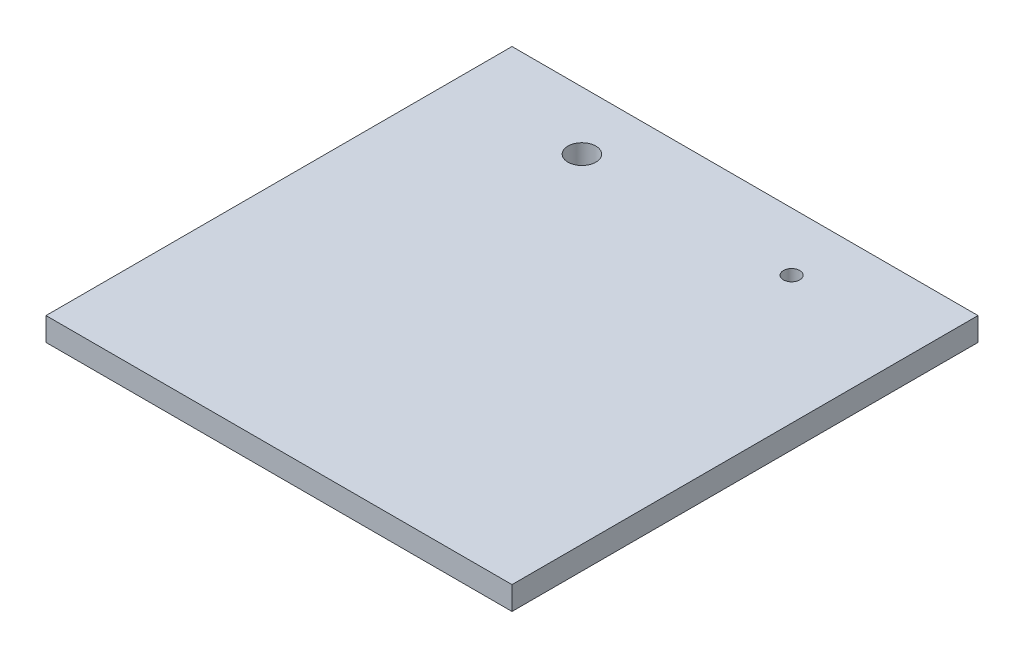
ISO-10303-21;
HEADER;
FILE_DESCRIPTION(('STEP AP214'),'2;1');
FILE_NAME('part.step','',(''),(''),'','','');
FILE_SCHEMA(('AUTOMOTIVE_DESIGN { 1 0 10303 214 1 1 1 1 }'));
ENDSEC;
DATA;
#1=APPLICATION_CONTEXT('core data for automotive mechanical design processes');
#2=APPLICATION_PROTOCOL_DEFINITION('international standard','automotive_design',2000,#1);
#3=PRODUCT_CONTEXT('',#1,'mechanical');
#4=PRODUCT('Part','Part','',(#3));
#5=PRODUCT_RELATED_PRODUCT_CATEGORY('part','',(#4));
#6=PRODUCT_DEFINITION_FORMATION('','',#4);
#7=PRODUCT_DEFINITION_CONTEXT('part definition',#1,'design');
#8=PRODUCT_DEFINITION('design','',#6,#7);
#9=PRODUCT_DEFINITION_SHAPE('','',#8);
#10=(LENGTH_UNIT() NAMED_UNIT(*) SI_UNIT(.MILLI.,.METRE.));
#11=(NAMED_UNIT(*) PLANE_ANGLE_UNIT() SI_UNIT($,.RADIAN.));
#12=(NAMED_UNIT(*) SI_UNIT($,.STERADIAN.) SOLID_ANGLE_UNIT());
#13=UNCERTAINTY_MEASURE_WITH_UNIT(LENGTH_MEASURE(1.E-05),#10,'distance_accuracy_value','');
#14=(GEOMETRIC_REPRESENTATION_CONTEXT(3) GLOBAL_UNCERTAINTY_ASSIGNED_CONTEXT((#13)) GLOBAL_UNIT_ASSIGNED_CONTEXT((#10,
#11,#12)) REPRESENTATION_CONTEXT('',''));
#15=CARTESIAN_POINT('',(0.,0.,0.));
#16=DIRECTION('',(0.,0.,1.));
#17=DIRECTION('',(1.,0.,0.));
#18=AXIS2_PLACEMENT_3D('',#15,#16,#17);
#19=CARTESIAN_POINT('',(-100.,10.,-100.));
#20=DIRECTION('',(1.,0.,0.));
#21=DIRECTION('',(0.,0.,-1.));
#22=AXIS2_PLACEMENT_3D('',#19,#20,#21);
#23=PLANE('',#22);
#24=DIRECTION('',(0.,0.,1.));
#25=VECTOR('',#24,1.);
#26=CARTESIAN_POINT('',(-100.,0.,-100.));
#27=LINE('',#26,#25);
#28=CARTESIAN_POINT('',(-100.,0.,-100.));
#29=VERTEX_POINT('',#28);
#30=CARTESIAN_POINT('',(-100.,0.,100.));
#31=VERTEX_POINT('',#30);
#32=EDGE_CURVE('E113',#29,#31,#27,.T.);
#33=ORIENTED_EDGE('',*,*,#32,.T.);
#34=DIRECTION('',(0.,-1.,0.));
#35=VECTOR('',#34,1.);
#36=CARTESIAN_POINT('',(-100.,10.,100.));
#37=LINE('',#36,#35);
#38=CARTESIAN_POINT('',(-100.,10.,100.));
#39=VERTEX_POINT('',#38);
#40=EDGE_CURVE('E11',#39,#31,#37,.T.);
#41=ORIENTED_EDGE('',*,*,#40,.F.);
#42=DIRECTION('',(0.,0.,1.));
#43=VECTOR('',#42,1.);
#44=CARTESIAN_POINT('',(-100.,10.,-100.));
#45=LINE('',#44,#43);
#46=CARTESIAN_POINT('',(-100.,10.,-100.));
#47=VERTEX_POINT('',#46);
#48=EDGE_CURVE('E97',#47,#39,#45,.T.);
#49=ORIENTED_EDGE('',*,*,#48,.F.);
#50=DIRECTION('',(0.,-1.,0.));
#51=VECTOR('',#50,1.);
#52=CARTESIAN_POINT('',(-100.,10.,-100.));
#53=LINE('',#52,#51);
#54=EDGE_CURVE('E109',#47,#29,#53,.T.);
#55=ORIENTED_EDGE('',*,*,#54,.T.);
#56=EDGE_LOOP('',(#33,#41,#49,#55));
#57=FACE_BOUND('',#56,.T.);
#58=ADVANCED_FACE('F45',(#57),#23,.F.);
#59=CARTESIAN_POINT('',(-100.,10.,100.));
#60=DIRECTION('',(0.,0.,-1.));
#61=DIRECTION('',(-1.,0.,0.));
#62=AXIS2_PLACEMENT_3D('',#59,#60,#61);
#63=PLANE('',#62);
#64=DIRECTION('',(1.,0.,0.));
#65=VECTOR('',#64,1.);
#66=CARTESIAN_POINT('',(-100.,0.,100.));
#67=LINE('',#66,#65);
#68=CARTESIAN_POINT('',(100.,0.,100.));
#69=VERTEX_POINT('',#68);
#70=EDGE_CURVE('E102',#31,#69,#67,.T.);
#71=ORIENTED_EDGE('',*,*,#70,.T.);
#72=DIRECTION('',(0.,-1.,0.));
#73=VECTOR('',#72,1.);
#74=CARTESIAN_POINT('',(100.,10.,100.));
#75=LINE('',#74,#73);
#76=CARTESIAN_POINT('',(100.,10.,100.));
#77=VERTEX_POINT('',#76);
#78=EDGE_CURVE('E54',#77,#69,#75,.T.);
#79=ORIENTED_EDGE('',*,*,#78,.F.);
#80=DIRECTION('',(1.,0.,0.));
#81=VECTOR('',#80,1.);
#82=CARTESIAN_POINT('',(-100.,10.,100.));
#83=LINE('',#82,#81);
#84=EDGE_CURVE('E92',#39,#77,#83,.T.);
#85=ORIENTED_EDGE('',*,*,#84,.F.);
#86=ORIENTED_EDGE('',*,*,#40,.T.);
#87=EDGE_LOOP('',(#71,#79,#85,#86));
#88=FACE_BOUND('',#87,.T.);
#89=ADVANCED_FACE('F101',(#88),#63,.F.);
#90=CARTESIAN_POINT('',(100.,10.,-100.));
#91=DIRECTION('',(-1.,0.,0.));
#92=DIRECTION('',(0.,0.,1.));
#93=AXIS2_PLACEMENT_3D('',#90,#91,#92);
#94=PLANE('',#93);
#95=DIRECTION('',(0.,0.,-1.));
#96=VECTOR('',#95,1.);
#97=CARTESIAN_POINT('',(100.,0.,-100.));
#98=LINE('',#97,#96);
#99=CARTESIAN_POINT('',(100.,0.,-100.));
#100=VERTEX_POINT('',#99);
#101=EDGE_CURVE('E79',#69,#100,#98,.T.);
#102=ORIENTED_EDGE('',*,*,#101,.T.);
#103=DIRECTION('',(0.,-1.,0.));
#104=VECTOR('',#103,1.);
#105=CARTESIAN_POINT('',(100.,10.,-100.));
#106=LINE('',#105,#104);
#107=CARTESIAN_POINT('',(100.,10.,-100.));
#108=VERTEX_POINT('',#107);
#109=EDGE_CURVE('E104',#108,#100,#106,.T.);
#110=ORIENTED_EDGE('',*,*,#109,.F.);
#111=DIRECTION('',(0.,0.,-1.));
#112=VECTOR('',#111,1.);
#113=CARTESIAN_POINT('',(100.,10.,-100.));
#114=LINE('',#113,#112);
#115=EDGE_CURVE('E95',#77,#108,#114,.T.);
#116=ORIENTED_EDGE('',*,*,#115,.F.);
#117=ORIENTED_EDGE('',*,*,#78,.T.);
#118=EDGE_LOOP('',(#102,#110,#116,#117));
#119=FACE_BOUND('',#118,.T.);
#120=ADVANCED_FACE('F105',(#119),#94,.F.);
#121=CARTESIAN_POINT('',(-100.,10.,-100.));
#122=DIRECTION('',(0.,0.,1.));
#123=DIRECTION('',(1.,0.,0.));
#124=AXIS2_PLACEMENT_3D('',#121,#122,#123);
#125=PLANE('',#124);
#126=DIRECTION('',(-1.,0.,0.));
#127=VECTOR('',#126,1.);
#128=CARTESIAN_POINT('',(-100.,0.,-100.));
#129=LINE('',#128,#127);
#130=EDGE_CURVE('E85',#100,#29,#129,.T.);
#131=ORIENTED_EDGE('',*,*,#130,.T.);
#132=ORIENTED_EDGE('',*,*,#54,.F.);
#133=DIRECTION('',(-1.,0.,0.));
#134=VECTOR('',#133,1.);
#135=CARTESIAN_POINT('',(-100.,10.,-100.));
#136=LINE('',#135,#134);
#137=EDGE_CURVE('E62',#108,#47,#136,.T.);
#138=ORIENTED_EDGE('',*,*,#137,.F.);
#139=ORIENTED_EDGE('',*,*,#109,.T.);
#140=EDGE_LOOP('',(#131,#132,#138,#139));
#141=FACE_BOUND('',#140,.T.);
#142=ADVANCED_FACE('F127',(#141),#125,.F.);
#143=CARTESIAN_POINT('',(0.,10.,0.));
#144=DIRECTION('',(0.,1.,0.));
#145=DIRECTION('',(0.,0.,1.));
#146=AXIS2_PLACEMENT_3D('',#143,#144,#145);
#147=PLANE('',#146);
#148=CARTESIAN_POINT('',(-45.,10.,-75.));
#149=DIRECTION('',(0.,1.,0.));
#150=DIRECTION('',(0.,0.,1.));
#151=AXIS2_PLACEMENT_3D('',#148,#149,#150);
#152=CIRCLE('',#151,6.00000000000001);
#153=CARTESIAN_POINT('',(-45.,10.,-69.));
#154=VERTEX_POINT('',#153);
#155=EDGE_CURVE('E142',#154,#154,#152,.T.);
#156=ORIENTED_EDGE('',*,*,#155,.F.);
#157=EDGE_LOOP('',(#156));
#158=FACE_BOUND('',#157,.T.);
#159=CARTESIAN_POINT('',(45.,10.,-75.));
#160=DIRECTION('',(0.,1.,0.));
#161=DIRECTION('',(0.,0.,1.));
#162=AXIS2_PLACEMENT_3D('',#159,#160,#161);
#163=CIRCLE('',#162,3.50000000000001);
#164=CARTESIAN_POINT('',(45.,10.,-71.5));
#165=VERTEX_POINT('',#164);
#166=EDGE_CURVE('E134',#165,#165,#163,.T.);
#167=ORIENTED_EDGE('',*,*,#166,.F.);
#168=EDGE_LOOP('',(#167));
#169=FACE_BOUND('',#168,.T.);
#170=ORIENTED_EDGE('',*,*,#48,.T.);
#171=ORIENTED_EDGE('',*,*,#84,.T.);
#172=ORIENTED_EDGE('',*,*,#115,.T.);
#173=ORIENTED_EDGE('',*,*,#137,.T.);
#174=EDGE_LOOP('',(#170,#171,#172,#173));
#175=FACE_BOUND('',#174,.T.);
#176=ADVANCED_FACE('F93',(#158,#169,#175),#147,.T.);
#177=CARTESIAN_POINT('',(0.,0.,0.));
#178=DIRECTION('',(0.,1.,0.));
#179=DIRECTION('',(0.,0.,1.));
#180=AXIS2_PLACEMENT_3D('',#177,#178,#179);
#181=PLANE('',#180);
#182=CARTESIAN_POINT('',(-45.,0.,-75.));
#183=DIRECTION('',(0.,1.,0.));
#184=DIRECTION('',(0.,0.,1.));
#185=AXIS2_PLACEMENT_3D('',#182,#183,#184);
#186=CIRCLE('',#185,6.00000000000001);
#187=CARTESIAN_POINT('',(-45.,0.,-69.));
#188=VERTEX_POINT('',#187);
#189=EDGE_CURVE('E138',#188,#188,#186,.T.);
#190=ORIENTED_EDGE('',*,*,#189,.T.);
#191=EDGE_LOOP('',(#190));
#192=FACE_BOUND('',#191,.T.);
#193=CARTESIAN_POINT('',(45.,0.,-75.));
#194=DIRECTION('',(0.,1.,0.));
#195=DIRECTION('',(0.,0.,1.));
#196=AXIS2_PLACEMENT_3D('',#193,#194,#195);
#197=CIRCLE('',#196,3.50000000000001);
#198=CARTESIAN_POINT('',(45.,0.,-71.5));
#199=VERTEX_POINT('',#198);
#200=EDGE_CURVE('E117',#199,#199,#197,.T.);
#201=ORIENTED_EDGE('',*,*,#200,.T.);
#202=EDGE_LOOP('',(#201));
#203=FACE_BOUND('',#202,.T.);
#204=ORIENTED_EDGE('',*,*,#32,.F.);
#205=ORIENTED_EDGE('',*,*,#130,.F.);
#206=ORIENTED_EDGE('',*,*,#101,.F.);
#207=ORIENTED_EDGE('',*,*,#70,.F.);
#208=EDGE_LOOP('',(#204,#205,#206,#207));
#209=FACE_BOUND('',#208,.T.);
#210=ADVANCED_FACE('F130',(#192,#203,#209),#181,.F.);
#211=CARTESIAN_POINT('',(45.,0.,-75.));
#212=DIRECTION('',(0.,1.,0.));
#213=DIRECTION('',(0.,0.,1.));
#214=AXIS2_PLACEMENT_3D('',#211,#212,#213);
#215=CYLINDRICAL_SURFACE('',#214,3.50000000000001);
#216=ORIENTED_EDGE('',*,*,#200,.F.);
#217=EDGE_LOOP('',(#216));
#218=FACE_BOUND('',#217,.T.);
#219=ORIENTED_EDGE('',*,*,#166,.T.);
#220=EDGE_LOOP('',(#219));
#221=FACE_BOUND('',#220,.T.);
#222=ADVANCED_FACE('F155',(#218,#221),#215,.F.);
#223=CARTESIAN_POINT('',(-45.,0.,-75.));
#224=DIRECTION('',(0.,1.,0.));
#225=DIRECTION('',(0.,0.,1.));
#226=AXIS2_PLACEMENT_3D('',#223,#224,#225);
#227=CYLINDRICAL_SURFACE('',#226,6.00000000000001);
#228=ORIENTED_EDGE('',*,*,#189,.F.);
#229=EDGE_LOOP('',(#228));
#230=FACE_BOUND('',#229,.T.);
#231=ORIENTED_EDGE('',*,*,#155,.T.);
#232=EDGE_LOOP('',(#231));
#233=FACE_BOUND('',#232,.T.);
#234=ADVANCED_FACE('F152',(#230,#233),#227,.F.);
#235=CLOSED_SHELL('',(#58,#89,#120,#142,#176,#210,#222,#234));
#236=MANIFOLD_SOLID_BREP('B2',#235);
#237=ADVANCED_BREP_SHAPE_REPRESENTATION('',(#18,#236),#14);
#238=SHAPE_DEFINITION_REPRESENTATION(#9,#237);
ENDSEC;
END-ISO-10303-21;
